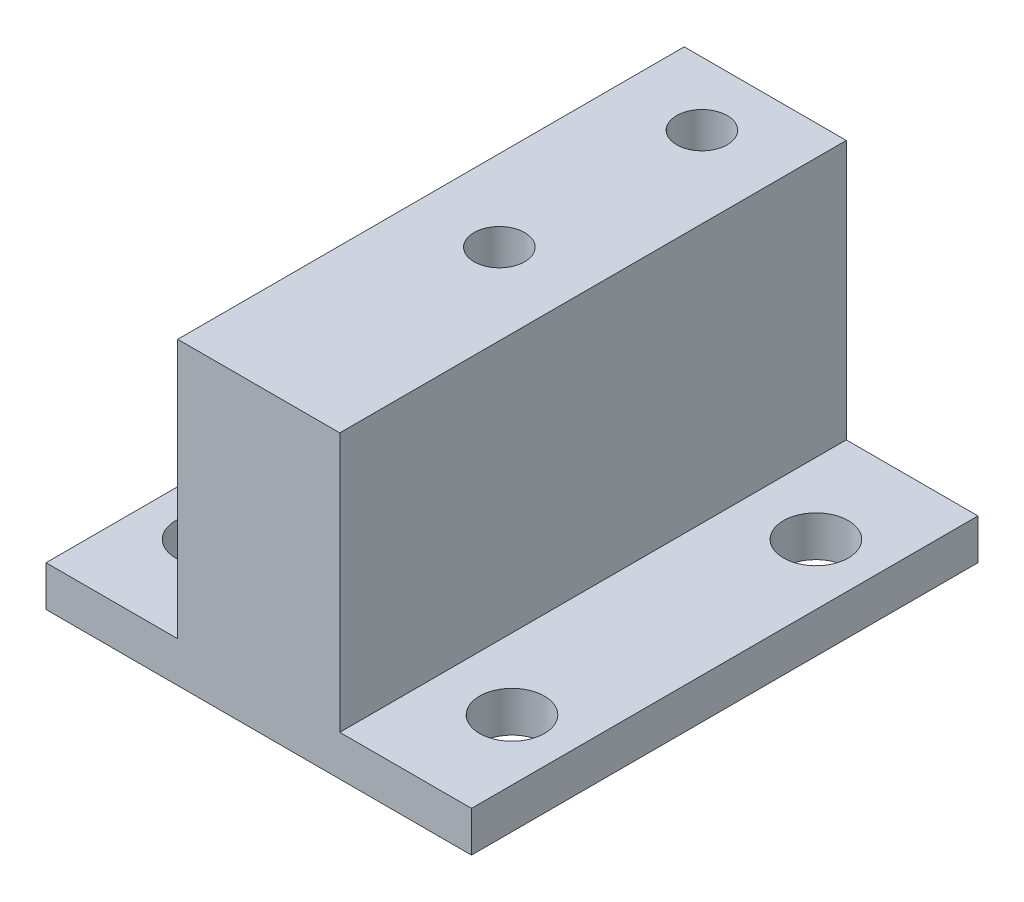
ISO-10303-21;
HEADER;
FILE_DESCRIPTION(('STEP AP214'),'2;1');
FILE_NAME('part.step','',(''),(''),'','','');
FILE_SCHEMA(('AUTOMOTIVE_DESIGN { 1 0 10303 214 1 1 1 1 }'));
ENDSEC;
DATA;
#1=APPLICATION_CONTEXT('core data for automotive mechanical design processes');
#2=APPLICATION_PROTOCOL_DEFINITION('international standard','automotive_design',2000,#1);
#3=PRODUCT_CONTEXT('',#1,'mechanical');
#4=PRODUCT('Part','Part','',(#3));
#5=PRODUCT_RELATED_PRODUCT_CATEGORY('part','',(#4));
#6=PRODUCT_DEFINITION_FORMATION('','',#4);
#7=PRODUCT_DEFINITION_CONTEXT('part definition',#1,'design');
#8=PRODUCT_DEFINITION('design','',#6,#7);
#9=PRODUCT_DEFINITION_SHAPE('','',#8);
#10=(LENGTH_UNIT() NAMED_UNIT(*) SI_UNIT(.MILLI.,.METRE.));
#11=(NAMED_UNIT(*) PLANE_ANGLE_UNIT() SI_UNIT($,.RADIAN.));
#12=(NAMED_UNIT(*) SI_UNIT($,.STERADIAN.) SOLID_ANGLE_UNIT());
#13=UNCERTAINTY_MEASURE_WITH_UNIT(LENGTH_MEASURE(1.E-05),#10,'distance_accuracy_value','');
#14=(GEOMETRIC_REPRESENTATION_CONTEXT(3) GLOBAL_UNCERTAINTY_ASSIGNED_CONTEXT((#13)) GLOBAL_UNIT_ASSIGNED_CONTEXT((#10,
#11,#12)) REPRESENTATION_CONTEXT('',''));
#15=CARTESIAN_POINT('',(0.,0.,0.));
#16=DIRECTION('',(0.,0.,1.));
#17=DIRECTION('',(1.,0.,0.));
#18=AXIS2_PLACEMENT_3D('',#15,#16,#17);
#19=CARTESIAN_POINT('',(20.,14.8,20.));
#20=DIRECTION('',(0.,1.,0.));
#21=DIRECTION('',(0.,0.,1.));
#22=AXIS2_PLACEMENT_3D('',#19,#20,#21);
#23=CYLINDRICAL_SURFACE('',#22,1.6);
#24=CARTESIAN_POINT('',(20.,0.,20.));
#25=DIRECTION('',(0.,1.,0.));
#26=DIRECTION('',(0.,0.,1.));
#27=AXIS2_PLACEMENT_3D('',#24,#25,#26);
#28=CIRCLE('',#27,1.6);
#29=CARTESIAN_POINT('',(20.,0.,21.6));
#30=VERTEX_POINT('',#29);
#31=EDGE_CURVE('E180',#30,#30,#28,.T.);
#32=ORIENTED_EDGE('',*,*,#31,.F.);
#33=EDGE_LOOP('',(#32));
#34=FACE_BOUND('',#33,.T.);
#35=CARTESIAN_POINT('',(20.,2.,20.));
#36=DIRECTION('',(0.,1.,0.));
#37=DIRECTION('',(0.,0.,1.));
#38=AXIS2_PLACEMENT_3D('',#35,#36,#37);
#39=CIRCLE('',#38,1.6);
#40=CARTESIAN_POINT('',(20.,2.,21.6));
#41=VERTEX_POINT('',#40);
#42=EDGE_CURVE('E391',#41,#41,#39,.F.);
#43=ORIENTED_EDGE('',*,*,#42,.F.);
#44=EDGE_LOOP('',(#43));
#45=FACE_BOUND('',#44,.T.);
#46=ADVANCED_FACE('F36',(#34,#45),#23,.F.);
#47=CARTESIAN_POINT('',(20.,14.8,5.));
#48=DIRECTION('',(0.,1.,0.));
#49=DIRECTION('',(0.,0.,1.));
#50=AXIS2_PLACEMENT_3D('',#47,#48,#49);
#51=CYLINDRICAL_SURFACE('',#50,1.6);
#52=CARTESIAN_POINT('',(20.,0.,5.));
#53=DIRECTION('',(0.,1.,0.));
#54=DIRECTION('',(0.,0.,1.));
#55=AXIS2_PLACEMENT_3D('',#52,#53,#54);
#56=CIRCLE('',#55,1.6);
#57=CARTESIAN_POINT('',(20.,0.,6.6));
#58=VERTEX_POINT('',#57);
#59=EDGE_CURVE('E177',#58,#58,#56,.T.);
#60=ORIENTED_EDGE('',*,*,#59,.F.);
#61=EDGE_LOOP('',(#60));
#62=FACE_BOUND('',#61,.T.);
#63=CARTESIAN_POINT('',(20.,2.,5.));
#64=DIRECTION('',(0.,1.,0.));
#65=DIRECTION('',(0.,0.,1.));
#66=AXIS2_PLACEMENT_3D('',#63,#64,#65);
#67=CIRCLE('',#66,1.6);
#68=CARTESIAN_POINT('',(20.,2.,6.6));
#69=VERTEX_POINT('',#68);
#70=EDGE_CURVE('E388',#69,#69,#67,.F.);
#71=ORIENTED_EDGE('',*,*,#70,.F.);
#72=EDGE_LOOP('',(#71));
#73=FACE_BOUND('',#72,.T.);
#74=ADVANCED_FACE('F214',(#62,#73),#51,.F.);
#75=CARTESIAN_POINT('',(23.,-4.74,25.));
#76=DIRECTION('',(-1.,0.,0.));
#77=DIRECTION('',(0.,0.,1.));
#78=AXIS2_PLACEMENT_3D('',#75,#76,#77);
#79=PLANE('',#78);
#80=DIRECTION('',(0.,0.,-1.));
#81=VECTOR('',#80,1.);
#82=CARTESIAN_POINT('',(23.,2.,25.));
#83=LINE('',#82,#81);
#84=CARTESIAN_POINT('',(23.,2.,25.));
#85=VERTEX_POINT('',#84);
#86=CARTESIAN_POINT('',(23.,2.,0.));
#87=VERTEX_POINT('',#86);
#88=EDGE_CURVE('E108',#85,#87,#83,.T.);
#89=ORIENTED_EDGE('',*,*,#88,.F.);
#90=DIRECTION('',(0.,1.,0.));
#91=VECTOR('',#90,1.);
#92=CARTESIAN_POINT('',(23.,-4.74,25.));
#93=LINE('',#92,#91);
#94=CARTESIAN_POINT('',(23.,0.,25.));
#95=VERTEX_POINT('',#94);
#96=EDGE_CURVE('E130',#95,#85,#93,.T.);
#97=ORIENTED_EDGE('',*,*,#96,.F.);
#98=DIRECTION('',(0.,0.,1.));
#99=VECTOR('',#98,1.);
#100=CARTESIAN_POINT('',(23.,0.,0.));
#101=LINE('',#100,#99);
#102=CARTESIAN_POINT('',(23.,0.,0.));
#103=VERTEX_POINT('',#102);
#104=EDGE_CURVE('E129',#103,#95,#101,.T.);
#105=ORIENTED_EDGE('',*,*,#104,.F.);
#106=DIRECTION('',(0.,1.,0.));
#107=VECTOR('',#106,1.);
#108=CARTESIAN_POINT('',(23.,-4.74,0.));
#109=LINE('',#108,#107);
#110=EDGE_CURVE('E120',#103,#87,#109,.T.);
#111=ORIENTED_EDGE('',*,*,#110,.T.);
#112=EDGE_LOOP('',(#89,#97,#105,#111));
#113=FACE_BOUND('',#112,.T.);
#114=ADVANCED_FACE('F127',(#113),#79,.F.);
#115=CARTESIAN_POINT('',(5.,14.8,20.));
#116=DIRECTION('',(0.,1.,0.));
#117=DIRECTION('',(0.,0.,1.));
#118=AXIS2_PLACEMENT_3D('',#115,#116,#117);
#119=CYLINDRICAL_SURFACE('',#118,1.6);
#120=CARTESIAN_POINT('',(5.,0.,20.));
#121=DIRECTION('',(0.,1.,0.));
#122=DIRECTION('',(0.,0.,1.));
#123=AXIS2_PLACEMENT_3D('',#120,#121,#122);
#124=CIRCLE('',#123,1.6);
#125=CARTESIAN_POINT('',(5.,0.,21.6));
#126=VERTEX_POINT('',#125);
#127=EDGE_CURVE('E183',#126,#126,#124,.T.);
#128=ORIENTED_EDGE('',*,*,#127,.F.);
#129=EDGE_LOOP('',(#128));
#130=FACE_BOUND('',#129,.T.);
#131=CARTESIAN_POINT('',(5.,2.,20.));
#132=DIRECTION('',(0.,1.,0.));
#133=DIRECTION('',(0.,0.,1.));
#134=AXIS2_PLACEMENT_3D('',#131,#132,#133);
#135=CIRCLE('',#134,1.6);
#136=CARTESIAN_POINT('',(5.,2.,21.6));
#137=VERTEX_POINT('',#136);
#138=EDGE_CURVE('E131',#137,#137,#135,.F.);
#139=ORIENTED_EDGE('',*,*,#138,.F.);
#140=EDGE_LOOP('',(#139));
#141=FACE_BOUND('',#140,.T.);
#142=ADVANCED_FACE('F226',(#130,#141),#119,.F.);
#143=CARTESIAN_POINT('',(4.99999999999995,14.8,5.));
#144=DIRECTION('',(0.,1.,0.));
#145=DIRECTION('',(0.,0.,1.));
#146=AXIS2_PLACEMENT_3D('',#143,#144,#145);
#147=CYLINDRICAL_SURFACE('',#146,1.6);
#148=CARTESIAN_POINT('',(4.99999999999995,0.,5.));
#149=DIRECTION('',(0.,1.,0.));
#150=DIRECTION('',(0.,0.,1.));
#151=AXIS2_PLACEMENT_3D('',#148,#149,#150);
#152=CIRCLE('',#151,1.6);
#153=CARTESIAN_POINT('',(4.99999999999995,0.,6.6));
#154=VERTEX_POINT('',#153);
#155=EDGE_CURVE('E174',#154,#154,#152,.T.);
#156=ORIENTED_EDGE('',*,*,#155,.F.);
#157=EDGE_LOOP('',(#156));
#158=FACE_BOUND('',#157,.T.);
#159=CARTESIAN_POINT('',(4.99999999999995,2.,5.));
#160=DIRECTION('',(0.,1.,0.));
#161=DIRECTION('',(0.,0.,1.));
#162=AXIS2_PLACEMENT_3D('',#159,#160,#161);
#163=CIRCLE('',#162,1.6);
#164=CARTESIAN_POINT('',(4.99999999999995,2.,6.6));
#165=VERTEX_POINT('',#164);
#166=EDGE_CURVE('E135',#165,#165,#163,.F.);
#167=ORIENTED_EDGE('',*,*,#166,.F.);
#168=EDGE_LOOP('',(#167));
#169=FACE_BOUND('',#168,.T.);
#170=ADVANCED_FACE('F228',(#158,#169),#147,.F.);
#171=CARTESIAN_POINT('',(2.,-4.74,25.));
#172=DIRECTION('',(1.,0.,0.));
#173=DIRECTION('',(0.,0.,-1.));
#174=AXIS2_PLACEMENT_3D('',#171,#172,#173);
#175=PLANE('',#174);
#176=DIRECTION('',(0.,0.,1.));
#177=VECTOR('',#176,1.);
#178=CARTESIAN_POINT('',(2.,2.,25.));
#179=LINE('',#178,#177);
#180=CARTESIAN_POINT('',(2.,2.,0.));
#181=VERTEX_POINT('',#180);
#182=CARTESIAN_POINT('',(2.,2.,25.));
#183=VERTEX_POINT('',#182);
#184=EDGE_CURVE('E196',#181,#183,#179,.T.);
#185=ORIENTED_EDGE('',*,*,#184,.F.);
#186=DIRECTION('',(0.,1.,0.));
#187=VECTOR('',#186,1.);
#188=CARTESIAN_POINT('',(2.,-4.74,0.));
#189=LINE('',#188,#187);
#190=CARTESIAN_POINT('',(2.,0.,0.));
#191=VERTEX_POINT('',#190);
#192=EDGE_CURVE('E140',#191,#181,#189,.T.);
#193=ORIENTED_EDGE('',*,*,#192,.F.);
#194=DIRECTION('',(0.,0.,-1.));
#195=VECTOR('',#194,1.);
#196=CARTESIAN_POINT('',(2.,0.,0.));
#197=LINE('',#196,#195);
#198=CARTESIAN_POINT('',(2.,0.,25.));
#199=VERTEX_POINT('',#198);
#200=EDGE_CURVE('E143',#199,#191,#197,.T.);
#201=ORIENTED_EDGE('',*,*,#200,.F.);
#202=DIRECTION('',(0.,1.,0.));
#203=VECTOR('',#202,1.);
#204=CARTESIAN_POINT('',(2.,-4.74,25.));
#205=LINE('',#204,#203);
#206=EDGE_CURVE('E139',#199,#183,#205,.T.);
#207=ORIENTED_EDGE('',*,*,#206,.T.);
#208=EDGE_LOOP('',(#185,#193,#201,#207));
#209=FACE_BOUND('',#208,.T.);
#210=ADVANCED_FACE('F195',(#209),#175,.F.);
#211=CARTESIAN_POINT('',(0.,14.8,25.));
#212=DIRECTION('',(0.,0.,-1.));
#213=DIRECTION('',(-1.,0.,0.));
#214=AXIS2_PLACEMENT_3D('',#211,#212,#213);
#215=PLANE('',#214);
#216=DIRECTION('',(1.,0.,0.));
#217=VECTOR('',#216,1.);
#218=CARTESIAN_POINT('',(23.,2.,25.));
#219=LINE('',#218,#217);
#220=CARTESIAN_POINT('',(16.5,2.,25.));
#221=VERTEX_POINT('',#220);
#222=EDGE_CURVE('E53',#221,#85,#219,.T.);
#223=ORIENTED_EDGE('',*,*,#222,.F.);
#224=DIRECTION('',(0.,1.,0.));
#225=VECTOR('',#224,1.);
#226=CARTESIAN_POINT('',(16.5,5.03,25.));
#227=LINE('',#226,#225);
#228=CARTESIAN_POINT('',(16.5,14.8,25.));
#229=VERTEX_POINT('',#228);
#230=EDGE_CURVE('E150',#221,#229,#227,.T.);
#231=ORIENTED_EDGE('',*,*,#230,.T.);
#232=DIRECTION('',(1.,0.,0.));
#233=VECTOR('',#232,1.);
#234=CARTESIAN_POINT('',(0.,14.8,25.));
#235=LINE('',#234,#233);
#236=CARTESIAN_POINT('',(8.5,14.8,25.));
#237=VERTEX_POINT('',#236);
#238=EDGE_CURVE('E45',#237,#229,#235,.T.);
#239=ORIENTED_EDGE('',*,*,#238,.F.);
#240=DIRECTION('',(0.,1.,0.));
#241=VECTOR('',#240,1.);
#242=CARTESIAN_POINT('',(8.5,5.03,25.));
#243=LINE('',#242,#241);
#244=CARTESIAN_POINT('',(8.5,2.,25.));
#245=VERTEX_POINT('',#244);
#246=EDGE_CURVE('E157',#245,#237,#243,.T.);
#247=ORIENTED_EDGE('',*,*,#246,.F.);
#248=DIRECTION('',(1.,0.,0.));
#249=VECTOR('',#248,1.);
#250=CARTESIAN_POINT('',(8.5,2.,25.));
#251=LINE('',#250,#249);
#252=EDGE_CURVE('E401',#183,#245,#251,.T.);
#253=ORIENTED_EDGE('',*,*,#252,.F.);
#254=ORIENTED_EDGE('',*,*,#206,.F.);
#255=DIRECTION('',(1.,0.,0.));
#256=VECTOR('',#255,1.);
#257=CARTESIAN_POINT('',(0.,0.,25.));
#258=LINE('',#257,#256);
#259=EDGE_CURVE('E186',#199,#95,#258,.T.);
#260=ORIENTED_EDGE('',*,*,#259,.T.);
#261=ORIENTED_EDGE('',*,*,#96,.T.);
#262=EDGE_LOOP('',(#223,#231,#239,#247,#253,#254,#260,#261));
#263=FACE_BOUND('',#262,.T.);
#264=ADVANCED_FACE('F38',(#263),#215,.F.);
#265=CARTESIAN_POINT('',(0.,14.8,0.));
#266=DIRECTION('',(0.,0.,1.));
#267=DIRECTION('',(1.,0.,0.));
#268=AXIS2_PLACEMENT_3D('',#265,#266,#267);
#269=PLANE('',#268);
#270=DIRECTION('',(0.,1.,0.));
#271=VECTOR('',#270,1.);
#272=CARTESIAN_POINT('',(16.5,5.03,0.));
#273=LINE('',#272,#271);
#274=CARTESIAN_POINT('',(16.5,2.,0.));
#275=VERTEX_POINT('',#274);
#276=CARTESIAN_POINT('',(16.5,14.8,0.));
#277=VERTEX_POINT('',#276);
#278=EDGE_CURVE('E123',#275,#277,#273,.T.);
#279=ORIENTED_EDGE('',*,*,#278,.F.);
#280=DIRECTION('',(-1.,0.,0.));
#281=VECTOR('',#280,1.);
#282=CARTESIAN_POINT('',(23.,2.,0.));
#283=LINE('',#282,#281);
#284=EDGE_CURVE('E112',#87,#275,#283,.T.);
#285=ORIENTED_EDGE('',*,*,#284,.F.);
#286=ORIENTED_EDGE('',*,*,#110,.F.);
#287=DIRECTION('',(-1.,0.,0.));
#288=VECTOR('',#287,1.);
#289=CARTESIAN_POINT('',(0.,0.,0.));
#290=LINE('',#289,#288);
#291=EDGE_CURVE('E40',#103,#191,#290,.T.);
#292=ORIENTED_EDGE('',*,*,#291,.T.);
#293=ORIENTED_EDGE('',*,*,#192,.T.);
#294=DIRECTION('',(-1.,0.,0.));
#295=VECTOR('',#294,1.);
#296=CARTESIAN_POINT('',(8.5,2.,0.));
#297=LINE('',#296,#295);
#298=CARTESIAN_POINT('',(8.5,2.,0.));
#299=VERTEX_POINT('',#298);
#300=EDGE_CURVE('E61',#299,#181,#297,.T.);
#301=ORIENTED_EDGE('',*,*,#300,.F.);
#302=DIRECTION('',(0.,1.,0.));
#303=VECTOR('',#302,1.);
#304=CARTESIAN_POINT('',(8.5,5.03,0.));
#305=LINE('',#304,#303);
#306=CARTESIAN_POINT('',(8.5,14.8,0.));
#307=VERTEX_POINT('',#306);
#308=EDGE_CURVE('E158',#299,#307,#305,.T.);
#309=ORIENTED_EDGE('',*,*,#308,.T.);
#310=DIRECTION('',(-1.,0.,0.));
#311=VECTOR('',#310,1.);
#312=CARTESIAN_POINT('',(0.,14.8,0.));
#313=LINE('',#312,#311);
#314=EDGE_CURVE('E11',#277,#307,#313,.T.);
#315=ORIENTED_EDGE('',*,*,#314,.F.);
#316=EDGE_LOOP('',(#279,#285,#286,#292,#293,#301,#309,#315));
#317=FACE_BOUND('',#316,.T.);
#318=ADVANCED_FACE('F119',(#317),#269,.F.);
#319=CARTESIAN_POINT('',(0.,14.8,0.));
#320=DIRECTION('',(0.,1.,0.));
#321=DIRECTION('',(0.,0.,1.));
#322=AXIS2_PLACEMENT_3D('',#319,#320,#321);
#323=PLANE('',#322);
#324=DIRECTION('',(0.,0.,1.));
#325=VECTOR('',#324,1.);
#326=CARTESIAN_POINT('',(16.5,14.8,25.));
#327=LINE('',#326,#325);
#328=EDGE_CURVE('E148',#277,#229,#327,.T.);
#329=ORIENTED_EDGE('',*,*,#328,.F.);
#330=ORIENTED_EDGE('',*,*,#314,.T.);
#331=DIRECTION('',(0.,0.,-1.));
#332=VECTOR('',#331,1.);
#333=CARTESIAN_POINT('',(8.5,14.8,25.));
#334=LINE('',#333,#332);
#335=EDGE_CURVE('E153',#237,#307,#334,.T.);
#336=ORIENTED_EDGE('',*,*,#335,.F.);
#337=ORIENTED_EDGE('',*,*,#238,.T.);
#338=EDGE_LOOP('',(#329,#330,#336,#337));
#339=FACE_BOUND('',#338,.T.);
#340=CARTESIAN_POINT('',(12.5,14.8,3.12423319118437));
#341=DIRECTION('',(0.,1.,0.));
#342=DIRECTION('',(0.,0.,1.));
#343=AXIS2_PLACEMENT_3D('',#340,#341,#342);
#344=CIRCLE('',#343,1.25);
#345=CARTESIAN_POINT('',(12.5,14.8,4.37423319118436));
#346=VERTEX_POINT('',#345);
#347=EDGE_CURVE('E161',#346,#346,#344,.T.);
#348=ORIENTED_EDGE('',*,*,#347,.F.);
#349=EDGE_LOOP('',(#348));
#350=FACE_BOUND('',#349,.T.);
#351=CARTESIAN_POINT('',(12.5000000000001,14.8,13.1242331911844));
#352=DIRECTION('',(0.,1.,0.));
#353=DIRECTION('',(0.,0.,1.));
#354=AXIS2_PLACEMENT_3D('',#351,#352,#353);
#355=CIRCLE('',#354,1.25);
#356=CARTESIAN_POINT('',(12.5000000000001,14.8,14.3742331911844));
#357=VERTEX_POINT('',#356);
#358=EDGE_CURVE('E168',#357,#357,#355,.T.);
#359=ORIENTED_EDGE('',*,*,#358,.F.);
#360=EDGE_LOOP('',(#359));
#361=FACE_BOUND('',#360,.T.);
#362=ADVANCED_FACE('F200',(#339,#350,#361),#323,.T.);
#363=CARTESIAN_POINT('',(0.,0.,0.));
#364=DIRECTION('',(0.,1.,0.));
#365=DIRECTION('',(0.,0.,1.));
#366=AXIS2_PLACEMENT_3D('',#363,#364,#365);
#367=PLANE('',#366);
#368=ORIENTED_EDGE('',*,*,#155,.T.);
#369=EDGE_LOOP('',(#368));
#370=FACE_BOUND('',#369,.T.);
#371=ORIENTED_EDGE('',*,*,#59,.T.);
#372=EDGE_LOOP('',(#371));
#373=FACE_BOUND('',#372,.T.);
#374=ORIENTED_EDGE('',*,*,#31,.T.);
#375=EDGE_LOOP('',(#374));
#376=FACE_BOUND('',#375,.T.);
#377=ORIENTED_EDGE('',*,*,#127,.T.);
#378=EDGE_LOOP('',(#377));
#379=FACE_BOUND('',#378,.T.);
#380=ORIENTED_EDGE('',*,*,#291,.F.);
#381=ORIENTED_EDGE('',*,*,#104,.T.);
#382=ORIENTED_EDGE('',*,*,#259,.F.);
#383=ORIENTED_EDGE('',*,*,#200,.T.);
#384=EDGE_LOOP('',(#380,#381,#382,#383));
#385=FACE_BOUND('',#384,.T.);
#386=ADVANCED_FACE('F197',(#370,#373,#376,#379,#385),#367,.F.);
#387=CARTESIAN_POINT('',(12.5000000000001,7.3,13.1242331911844));
#388=DIRECTION('',(0.,1.,0.));
#389=DIRECTION('',(0.,0.,1.));
#390=AXIS2_PLACEMENT_3D('',#387,#388,#389);
#391=CONICAL_SURFACE('',#390,1.25,1.02974425867665);
#392=CARTESIAN_POINT('',(12.5000000000001,6.54892422621555,13.1242331911844));
#393=VERTEX_POINT('',#392);
#394=VERTEX_LOOP('',#393);
#395=FACE_BOUND('',#394,.T.);
#396=CARTESIAN_POINT('',(12.5000000000001,7.3,13.1242331911844));
#397=DIRECTION('',(0.,1.,0.));
#398=DIRECTION('',(0.,0.,1.));
#399=AXIS2_PLACEMENT_3D('',#396,#397,#398);
#400=CIRCLE('',#399,1.25);
#401=CARTESIAN_POINT('',(12.5000000000001,7.3,14.3742331911844));
#402=VERTEX_POINT('',#401);
#403=EDGE_CURVE('E171',#402,#402,#400,.T.);
#404=ORIENTED_EDGE('',*,*,#403,.T.);
#405=EDGE_LOOP('',(#404));
#406=FACE_BOUND('',#405,.T.);
#407=ADVANCED_FACE('F199',(#395,#406),#391,.F.);
#408=CARTESIAN_POINT('',(12.5000000000001,14.8,13.1242331911844));
#409=DIRECTION('',(0.,1.,0.));
#410=DIRECTION('',(0.,0.,1.));
#411=AXIS2_PLACEMENT_3D('',#408,#409,#410);
#412=CYLINDRICAL_SURFACE('',#411,1.25);
#413=ORIENTED_EDGE('',*,*,#403,.F.);
#414=EDGE_LOOP('',(#413));
#415=FACE_BOUND('',#414,.T.);
#416=ORIENTED_EDGE('',*,*,#358,.T.);
#417=EDGE_LOOP('',(#416));
#418=FACE_BOUND('',#417,.T.);
#419=ADVANCED_FACE('F207',(#415,#418),#412,.F.);
#420=CARTESIAN_POINT('',(12.5,7.3,3.12423319118437));
#421=DIRECTION('',(0.,1.,0.));
#422=DIRECTION('',(0.,0.,1.));
#423=AXIS2_PLACEMENT_3D('',#420,#421,#422);
#424=CONICAL_SURFACE('',#423,1.25,1.02974425867665);
#425=CARTESIAN_POINT('',(12.5,6.54892422621555,3.12423319118437));
#426=VERTEX_POINT('',#425);
#427=VERTEX_LOOP('',#426);
#428=FACE_BOUND('',#427,.T.);
#429=CARTESIAN_POINT('',(12.5,7.3,3.12423319118437));
#430=DIRECTION('',(0.,1.,0.));
#431=DIRECTION('',(0.,0.,1.));
#432=AXIS2_PLACEMENT_3D('',#429,#430,#431);
#433=CIRCLE('',#432,1.25);
#434=CARTESIAN_POINT('',(12.5,7.3,4.37423319118436));
#435=VERTEX_POINT('',#434);
#436=EDGE_CURVE('E165',#435,#435,#433,.T.);
#437=ORIENTED_EDGE('',*,*,#436,.T.);
#438=EDGE_LOOP('',(#437));
#439=FACE_BOUND('',#438,.T.);
#440=ADVANCED_FACE('F262',(#428,#439),#424,.F.);
#441=CARTESIAN_POINT('',(12.5,14.8,3.12423319118437));
#442=DIRECTION('',(0.,1.,0.));
#443=DIRECTION('',(0.,0.,1.));
#444=AXIS2_PLACEMENT_3D('',#441,#442,#443);
#445=CYLINDRICAL_SURFACE('',#444,1.25);
#446=ORIENTED_EDGE('',*,*,#436,.F.);
#447=EDGE_LOOP('',(#446));
#448=FACE_BOUND('',#447,.T.);
#449=ORIENTED_EDGE('',*,*,#347,.T.);
#450=EDGE_LOOP('',(#449));
#451=FACE_BOUND('',#450,.T.);
#452=ADVANCED_FACE('F258',(#448,#451),#445,.F.);
#453=CARTESIAN_POINT('',(8.5,5.03,25.));
#454=DIRECTION('',(1.,0.,0.));
#455=DIRECTION('',(0.,0.,-1.));
#456=AXIS2_PLACEMENT_3D('',#453,#454,#455);
#457=PLANE('',#456);
#458=ORIENTED_EDGE('',*,*,#335,.T.);
#459=ORIENTED_EDGE('',*,*,#308,.F.);
#460=DIRECTION('',(0.,0.,-1.));
#461=VECTOR('',#460,1.);
#462=CARTESIAN_POINT('',(8.5,2.,25.));
#463=LINE('',#462,#461);
#464=EDGE_CURVE('E397',#245,#299,#463,.T.);
#465=ORIENTED_EDGE('',*,*,#464,.F.);
#466=ORIENTED_EDGE('',*,*,#246,.T.);
#467=EDGE_LOOP('',(#458,#459,#465,#466));
#468=FACE_BOUND('',#467,.T.);
#469=ADVANCED_FACE('F249',(#468),#457,.F.);
#470=CARTESIAN_POINT('',(16.5,5.03,25.));
#471=DIRECTION('',(-1.,0.,0.));
#472=DIRECTION('',(0.,0.,1.));
#473=AXIS2_PLACEMENT_3D('',#470,#471,#472);
#474=PLANE('',#473);
#475=ORIENTED_EDGE('',*,*,#328,.T.);
#476=ORIENTED_EDGE('',*,*,#230,.F.);
#477=DIRECTION('',(0.,0.,1.));
#478=VECTOR('',#477,1.);
#479=CARTESIAN_POINT('',(16.5,2.,25.));
#480=LINE('',#479,#478);
#481=EDGE_CURVE('E125',#275,#221,#480,.T.);
#482=ORIENTED_EDGE('',*,*,#481,.F.);
#483=ORIENTED_EDGE('',*,*,#278,.T.);
#484=EDGE_LOOP('',(#475,#476,#482,#483));
#485=FACE_BOUND('',#484,.T.);
#486=ADVANCED_FACE('F242',(#485),#474,.F.);
#487=CARTESIAN_POINT('',(0.,2.,0.));
#488=DIRECTION('',(0.,1.,0.));
#489=DIRECTION('',(0.,0.,1.));
#490=AXIS2_PLACEMENT_3D('',#487,#488,#489);
#491=PLANE('',#490);
#492=ORIENTED_EDGE('',*,*,#464,.T.);
#493=ORIENTED_EDGE('',*,*,#300,.T.);
#494=ORIENTED_EDGE('',*,*,#184,.T.);
#495=ORIENTED_EDGE('',*,*,#252,.T.);
#496=EDGE_LOOP('',(#492,#493,#494,#495));
#497=FACE_BOUND('',#496,.T.);
#498=ORIENTED_EDGE('',*,*,#166,.T.);
#499=EDGE_LOOP('',(#498));
#500=FACE_BOUND('',#499,.T.);
#501=ORIENTED_EDGE('',*,*,#138,.T.);
#502=EDGE_LOOP('',(#501));
#503=FACE_BOUND('',#502,.T.);
#504=ADVANCED_FACE('F240',(#497,#500,#503),#491,.T.);
#505=CARTESIAN_POINT('',(0.,2.,0.));
#506=DIRECTION('',(0.,1.,0.));
#507=DIRECTION('',(0.,0.,1.));
#508=AXIS2_PLACEMENT_3D('',#505,#506,#507);
#509=PLANE('',#508);
#510=ORIENTED_EDGE('',*,*,#88,.T.);
#511=ORIENTED_EDGE('',*,*,#284,.T.);
#512=ORIENTED_EDGE('',*,*,#481,.T.);
#513=ORIENTED_EDGE('',*,*,#222,.T.);
#514=EDGE_LOOP('',(#510,#511,#512,#513));
#515=FACE_BOUND('',#514,.T.);
#516=ORIENTED_EDGE('',*,*,#70,.T.);
#517=EDGE_LOOP('',(#516));
#518=FACE_BOUND('',#517,.T.);
#519=ORIENTED_EDGE('',*,*,#42,.T.);
#520=EDGE_LOOP('',(#519));
#521=FACE_BOUND('',#520,.T.);
#522=ADVANCED_FACE('F110',(#515,#518,#521),#509,.T.);
#523=CLOSED_SHELL('',(#46,#74,#114,#142,#170,#210,#264,#318,#362,#386,#407,#419,#440,#452,#469,
#486,#504,#522));
#524=MANIFOLD_SOLID_BREP('B2',#523);
#525=ADVANCED_BREP_SHAPE_REPRESENTATION('',(#18,#524),#14);
#526=SHAPE_DEFINITION_REPRESENTATION(#9,#525);
ENDSEC;
END-ISO-10303-21;
